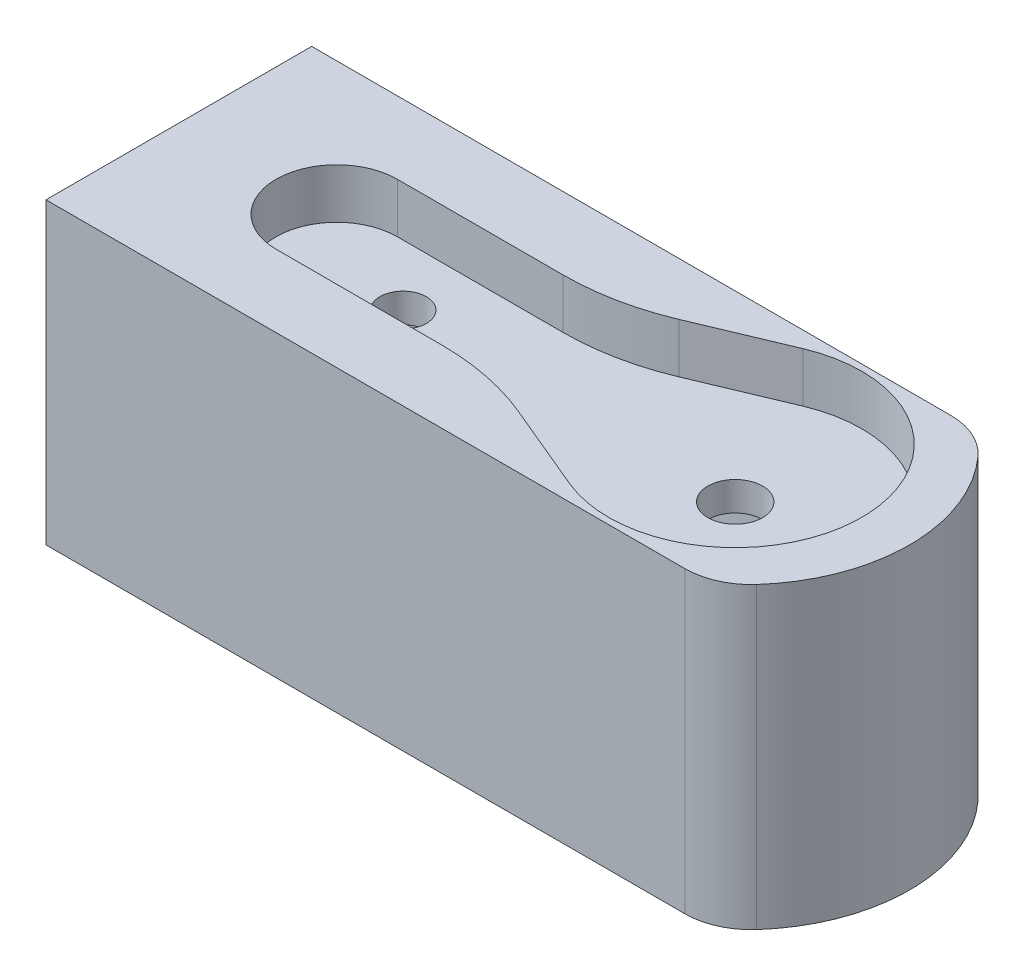
ISO-10303-21;
HEADER;
FILE_DESCRIPTION(('STEP AP214'),'2;1');
FILE_NAME('part.step','',(''),(''),'','','');
FILE_SCHEMA(('AUTOMOTIVE_DESIGN { 1 0 10303 214 1 1 1 1 }'));
ENDSEC;
DATA;
#1=APPLICATION_CONTEXT('core data for automotive mechanical design processes');
#2=APPLICATION_PROTOCOL_DEFINITION('international standard','automotive_design',2000,#1);
#3=PRODUCT_CONTEXT('',#1,'mechanical');
#4=PRODUCT('Part','Part','',(#3));
#5=PRODUCT_RELATED_PRODUCT_CATEGORY('part','',(#4));
#6=PRODUCT_DEFINITION_FORMATION('','',#4);
#7=PRODUCT_DEFINITION_CONTEXT('part definition',#1,'design');
#8=PRODUCT_DEFINITION('design','',#6,#7);
#9=PRODUCT_DEFINITION_SHAPE('','',#8);
#10=(LENGTH_UNIT() NAMED_UNIT(*) SI_UNIT(.MILLI.,.METRE.));
#11=(NAMED_UNIT(*) PLANE_ANGLE_UNIT() SI_UNIT($,.RADIAN.));
#12=(NAMED_UNIT(*) SI_UNIT($,.STERADIAN.) SOLID_ANGLE_UNIT());
#13=UNCERTAINTY_MEASURE_WITH_UNIT(LENGTH_MEASURE(1.E-05),#10,'distance_accuracy_value','');
#14=(GEOMETRIC_REPRESENTATION_CONTEXT(3) GLOBAL_UNCERTAINTY_ASSIGNED_CONTEXT((#13)) GLOBAL_UNIT_ASSIGNED_CONTEXT((#10,
#11,#12)) REPRESENTATION_CONTEXT('',''));
#15=CARTESIAN_POINT('',(0.,0.,0.));
#16=DIRECTION('',(0.,0.,1.));
#17=DIRECTION('',(1.,0.,0.));
#18=AXIS2_PLACEMENT_3D('',#15,#16,#17);
#19=CARTESIAN_POINT('',(0.,-2.,0.));
#20=DIRECTION('',(0.,0.,1.));
#21=DIRECTION('',(1.,0.,0.));
#22=AXIS2_PLACEMENT_3D('',#19,#20,#21);
#23=PLANE('',#22);
#24=DIRECTION('',(0.,1.,0.));
#25=VECTOR('',#24,1.);
#26=CARTESIAN_POINT('',(23.4772847206615,-2.,0.));
#27=LINE('',#26,#25);
#28=CARTESIAN_POINT('',(23.4772847206614,-2.,0.));
#29=VERTEX_POINT('',#28);
#30=CARTESIAN_POINT('',(23.4772847206614,16.,0.));
#31=VERTEX_POINT('',#30);
#32=EDGE_CURVE('E317',#29,#31,#27,.T.);
#33=ORIENTED_EDGE('',*,*,#32,.T.);
#34=DIRECTION('',(-1.,0.,0.));
#35=VECTOR('',#34,1.);
#36=CARTESIAN_POINT('',(0.,16.,0.));
#37=LINE('',#36,#35);
#38=CARTESIAN_POINT('',(-15.,16.,0.));
#39=VERTEX_POINT('',#38);
#40=EDGE_CURVE('E235',#31,#39,#37,.T.);
#41=ORIENTED_EDGE('',*,*,#40,.T.);
#42=DIRECTION('',(0.,1.,0.));
#43=VECTOR('',#42,1.);
#44=CARTESIAN_POINT('',(-15.,-2.,0.));
#45=LINE('',#44,#43);
#46=CARTESIAN_POINT('',(-15.,-2.,0.));
#47=VERTEX_POINT('',#46);
#48=EDGE_CURVE('E303',#47,#39,#45,.T.);
#49=ORIENTED_EDGE('',*,*,#48,.F.);
#50=DIRECTION('',(1.,0.,0.));
#51=VECTOR('',#50,1.);
#52=CARTESIAN_POINT('',(0.,-2.,0.));
#53=LINE('',#52,#51);
#54=EDGE_CURVE('E309',#47,#29,#53,.T.);
#55=ORIENTED_EDGE('',*,*,#54,.T.);
#56=EDGE_LOOP('',(#33,#41,#49,#55));
#57=FACE_BOUND('',#56,.T.);
#58=ADVANCED_FACE('F38',(#57),#23,.T.);
#59=CARTESIAN_POINT('',(0.,-2.,-16.));
#60=DIRECTION('',(0.,0.,-1.));
#61=DIRECTION('',(-1.,0.,0.));
#62=AXIS2_PLACEMENT_3D('',#59,#60,#61);
#63=PLANE('',#62);
#64=DIRECTION('',(0.,-1.,0.));
#65=VECTOR('',#64,1.);
#66=CARTESIAN_POINT('',(-15.,-2.,-16.));
#67=LINE('',#66,#65);
#68=CARTESIAN_POINT('',(-15.,16.,-16.));
#69=VERTEX_POINT('',#68);
#70=CARTESIAN_POINT('',(-15.,-2.,-16.));
#71=VERTEX_POINT('',#70);
#72=EDGE_CURVE('E298',#69,#71,#67,.T.);
#73=ORIENTED_EDGE('',*,*,#72,.F.);
#74=DIRECTION('',(1.,0.,0.));
#75=VECTOR('',#74,1.);
#76=CARTESIAN_POINT('',(0.,16.,-16.));
#77=LINE('',#76,#75);
#78=CARTESIAN_POINT('',(23.4772847206614,16.,-16.));
#79=VERTEX_POINT('',#78);
#80=EDGE_CURVE('E55',#69,#79,#77,.T.);
#81=ORIENTED_EDGE('',*,*,#80,.T.);
#82=DIRECTION('',(0.,1.,0.));
#83=VECTOR('',#82,1.);
#84=CARTESIAN_POINT('',(23.4772847206614,-2.,-16.));
#85=LINE('',#84,#83);
#86=CARTESIAN_POINT('',(23.4772847206614,-2.,-16.));
#87=VERTEX_POINT('',#86);
#88=EDGE_CURVE('E11',#79,#87,#85,.F.);
#89=ORIENTED_EDGE('',*,*,#88,.T.);
#90=DIRECTION('',(-1.,0.,0.));
#91=VECTOR('',#90,1.);
#92=CARTESIAN_POINT('',(0.,-2.,-16.));
#93=LINE('',#92,#91);
#94=EDGE_CURVE('E315',#87,#71,#93,.T.);
#95=ORIENTED_EDGE('',*,*,#94,.T.);
#96=EDGE_LOOP('',(#73,#81,#89,#95));
#97=FACE_BOUND('',#96,.T.);
#98=ADVANCED_FACE('F346',(#97),#63,.T.);
#99=CARTESIAN_POINT('',(19.0051487656619,-2.,-8.));
#100=DIRECTION('',(0.,1.,0.));
#101=DIRECTION('',(0.,0.,1.));
#102=AXIS2_PLACEMENT_3D('',#99,#100,#101);
#103=CYLINDRICAL_SURFACE('',#102,10.);
#104=DIRECTION('',(0.,1.,0.));
#105=VECTOR('',#104,1.);
#106=CARTESIAN_POINT('',(26.4587086906612,-2.,-14.6666666666667));
#107=LINE('',#106,#105);
#108=CARTESIAN_POINT('',(26.4587086906612,-2.,-14.6666666666667));
#109=VERTEX_POINT('',#108);
#110=CARTESIAN_POINT('',(26.4587086906612,16.,-14.6666666666667));
#111=VERTEX_POINT('',#110);
#112=EDGE_CURVE('E320',#109,#111,#107,.T.);
#113=ORIENTED_EDGE('',*,*,#112,.T.);
#114=CARTESIAN_POINT('',(19.0051487656619,16.,-8.));
#115=DIRECTION('',(0.,1.,0.));
#116=DIRECTION('',(0.,0.,1.));
#117=AXIS2_PLACEMENT_3D('',#114,#115,#116);
#118=CIRCLE('',#117,10.);
#119=CARTESIAN_POINT('',(26.4587086906612,16.,-1.33333333333334));
#120=VERTEX_POINT('',#119);
#121=EDGE_CURVE('E243',#111,#120,#118,.F.);
#122=ORIENTED_EDGE('',*,*,#121,.T.);
#123=DIRECTION('',(0.,1.,0.));
#124=VECTOR('',#123,1.);
#125=CARTESIAN_POINT('',(26.4587086906612,-2.,-1.33333333333334));
#126=LINE('',#125,#124);
#127=CARTESIAN_POINT('',(26.4587086906612,-2.,-1.33333333333334));
#128=VERTEX_POINT('',#127);
#129=EDGE_CURVE('E323',#120,#128,#126,.F.);
#130=ORIENTED_EDGE('',*,*,#129,.T.);
#131=CARTESIAN_POINT('',(19.0051487656619,-2.,-8.));
#132=DIRECTION('',(0.,1.,0.));
#133=DIRECTION('',(0.,0.,1.));
#134=AXIS2_PLACEMENT_3D('',#131,#132,#133);
#135=CIRCLE('',#134,10.);
#136=EDGE_CURVE('E312',#128,#109,#135,.T.);
#137=ORIENTED_EDGE('',*,*,#136,.T.);
#138=EDGE_LOOP('',(#113,#122,#130,#137));
#139=FACE_BOUND('',#138,.T.);
#140=ADVANCED_FACE('F352',(#139),#103,.T.);
#141=CARTESIAN_POINT('',(23.4772847206615,-2.,-4.));
#142=DIRECTION('',(0.,1.,0.));
#143=DIRECTION('',(0.,0.,1.));
#144=AXIS2_PLACEMENT_3D('',#141,#142,#143);
#145=CYLINDRICAL_SURFACE('',#144,4.);
#146=ORIENTED_EDGE('',*,*,#129,.F.);
#147=CARTESIAN_POINT('',(23.4772847206615,16.,-4.));
#148=DIRECTION('',(0.,1.,0.));
#149=DIRECTION('',(0.,0.,1.));
#150=AXIS2_PLACEMENT_3D('',#147,#148,#149);
#151=CIRCLE('',#150,4.);
#152=EDGE_CURVE('E240',#120,#31,#151,.F.);
#153=ORIENTED_EDGE('',*,*,#152,.T.);
#154=ORIENTED_EDGE('',*,*,#32,.F.);
#155=CARTESIAN_POINT('',(23.4772847206615,-2.,-4.));
#156=DIRECTION('',(0.,1.,0.));
#157=DIRECTION('',(0.,0.,1.));
#158=AXIS2_PLACEMENT_3D('',#155,#156,#157);
#159=CIRCLE('',#158,4.);
#160=EDGE_CURVE('E47',#128,#29,#159,.F.);
#161=ORIENTED_EDGE('',*,*,#160,.F.);
#162=EDGE_LOOP('',(#146,#153,#154,#161));
#163=FACE_BOUND('',#162,.T.);
#164=ADVANCED_FACE('F355',(#163),#145,.T.);
#165=CARTESIAN_POINT('',(23.4772847206614,-2.,-12.));
#166=DIRECTION('',(0.,1.,0.));
#167=DIRECTION('',(0.,0.,1.));
#168=AXIS2_PLACEMENT_3D('',#165,#166,#167);
#169=CYLINDRICAL_SURFACE('',#168,4.);
#170=ORIENTED_EDGE('',*,*,#88,.F.);
#171=CARTESIAN_POINT('',(23.4772847206614,16.,-12.));
#172=DIRECTION('',(0.,1.,0.));
#173=DIRECTION('',(0.,0.,1.));
#174=AXIS2_PLACEMENT_3D('',#171,#172,#173);
#175=CIRCLE('',#174,4.);
#176=EDGE_CURVE('E237',#79,#111,#175,.F.);
#177=ORIENTED_EDGE('',*,*,#176,.T.);
#178=ORIENTED_EDGE('',*,*,#112,.F.);
#179=CARTESIAN_POINT('',(23.4772847206614,-2.,-12.));
#180=DIRECTION('',(0.,1.,0.));
#181=DIRECTION('',(0.,0.,1.));
#182=AXIS2_PLACEMENT_3D('',#179,#180,#181);
#183=CIRCLE('',#182,4.);
#184=EDGE_CURVE('E325',#87,#109,#183,.F.);
#185=ORIENTED_EDGE('',*,*,#184,.F.);
#186=EDGE_LOOP('',(#170,#177,#178,#185));
#187=FACE_BOUND('',#186,.T.);
#188=ADVANCED_FACE('F40',(#187),#169,.T.);
#189=CARTESIAN_POINT('',(-15.,0.,0.));
#190=DIRECTION('',(1.,0.,0.));
#191=DIRECTION('',(0.,0.,-1.));
#192=AXIS2_PLACEMENT_3D('',#189,#190,#191);
#193=PLANE('',#192);
#194=DIRECTION('',(0.,1.,0.));
#195=VECTOR('',#194,1.);
#196=CARTESIAN_POINT('',(-15.,13.25,-2.75));
#197=LINE('',#196,#195);
#198=CARTESIAN_POINT('',(-15.,0.749999999999997,-2.75));
#199=VERTEX_POINT('',#198);
#200=CARTESIAN_POINT('',(-15.,11.25,-2.75));
#201=VERTEX_POINT('',#200);
#202=EDGE_CURVE('E294',#199,#201,#197,.T.);
#203=ORIENTED_EDGE('',*,*,#202,.F.);
#204=DIRECTION('',(0.,0.,1.));
#205=VECTOR('',#204,1.);
#206=CARTESIAN_POINT('',(-15.,0.749999999999997,-2.75));
#207=LINE('',#206,#205);
#208=CARTESIAN_POINT('',(-15.,0.749999999999997,-13.25));
#209=VERTEX_POINT('',#208);
#210=EDGE_CURVE('E187',#209,#199,#207,.T.);
#211=ORIENTED_EDGE('',*,*,#210,.F.);
#212=DIRECTION('',(0.,-1.,0.));
#213=VECTOR('',#212,1.);
#214=CARTESIAN_POINT('',(-15.,2.75,-13.25));
#215=LINE('',#214,#213);
#216=CARTESIAN_POINT('',(-15.,11.25,-13.25));
#217=VERTEX_POINT('',#216);
#218=EDGE_CURVE('E296',#217,#209,#215,.T.);
#219=ORIENTED_EDGE('',*,*,#218,.F.);
#220=DIRECTION('',(0.,0.,-1.));
#221=VECTOR('',#220,1.);
#222=CARTESIAN_POINT('',(-15.,11.25,-13.25));
#223=LINE('',#222,#221);
#224=EDGE_CURVE('E190',#201,#217,#223,.T.);
#225=ORIENTED_EDGE('',*,*,#224,.F.);
#226=EDGE_LOOP('',(#203,#211,#219,#225));
#227=FACE_BOUND('',#226,.T.);
#228=DIRECTION('',(0.,0.,1.));
#229=VECTOR('',#228,1.);
#230=CARTESIAN_POINT('',(-15.,16.,0.));
#231=LINE('',#230,#229);
#232=EDGE_CURVE('E232',#69,#39,#231,.T.);
#233=ORIENTED_EDGE('',*,*,#232,.F.);
#234=ORIENTED_EDGE('',*,*,#72,.T.);
#235=DIRECTION('',(0.,0.,1.));
#236=VECTOR('',#235,1.);
#237=CARTESIAN_POINT('',(-15.,-2.,0.));
#238=LINE('',#237,#236);
#239=EDGE_CURVE('E300',#71,#47,#238,.T.);
#240=ORIENTED_EDGE('',*,*,#239,.T.);
#241=ORIENTED_EDGE('',*,*,#48,.T.);
#242=EDGE_LOOP('',(#233,#234,#240,#241));
#243=FACE_BOUND('',#242,.T.);
#244=ADVANCED_FACE('F362',(#227,#243),#193,.F.);
#245=CARTESIAN_POINT('',(-3.03344012728045,13.,-7.22587350151138));
#246=DIRECTION('',(0.387077720728365,0.,0.922047091051067));
#247=DIRECTION('',(0.922047091051067,0.,-0.387077720728365));
#248=AXIS2_PLACEMENT_3D('',#245,#246,#247);
#249=PLANE('',#248);
#250=DIRECTION('',(0.,1.,0.));
#251=VECTOR('',#250,1.);
#252=CARTESIAN_POINT('',(15.5543287995448,13.,-15.0290663096134));
#253=LINE('',#252,#251);
#254=CARTESIAN_POINT('',(15.5543287995448,13.,-15.0290663096134));
#255=VERTEX_POINT('',#254);
#256=CARTESIAN_POINT('',(15.5543287995448,16.,-15.0290663096134));
#257=VERTEX_POINT('',#256);
#258=EDGE_CURVE('E268',#255,#257,#253,.T.);
#259=ORIENTED_EDGE('',*,*,#258,.T.);
#260=DIRECTION('',(-0.922047091051067,0.,0.387077720728365));
#261=VECTOR('',#260,1.);
#262=CARTESIAN_POINT('',(-3.03344012728045,16.,-7.22587350151138));
#263=LINE('',#262,#261);
#264=CARTESIAN_POINT('',(10.2904906654779,16.,-12.819293634234));
#265=VERTEX_POINT('',#264);
#266=EDGE_CURVE('E227',#257,#265,#263,.T.);
#267=ORIENTED_EDGE('',*,*,#266,.T.);
#268=DIRECTION('',(0.,1.,0.));
#269=VECTOR('',#268,1.);
#270=CARTESIAN_POINT('',(10.2904906654779,13.,-12.819293634234));
#271=LINE('',#270,#269);
#272=CARTESIAN_POINT('',(10.2904906654779,13.,-12.819293634234));
#273=VERTEX_POINT('',#272);
#274=EDGE_CURVE('E267',#273,#265,#271,.T.);
#275=ORIENTED_EDGE('',*,*,#274,.F.);
#276=DIRECTION('',(0.922047091051067,0.,-0.387077720728365));
#277=VECTOR('',#276,1.);
#278=CARTESIAN_POINT('',(-3.03344012728045,13.,-7.22587350151138));
#279=LINE('',#278,#277);
#280=EDGE_CURVE('E246',#273,#255,#279,.T.);
#281=ORIENTED_EDGE('',*,*,#280,.T.);
#282=EDGE_LOOP('',(#259,#267,#275,#281));
#283=FACE_BOUND('',#282,.T.);
#284=ADVANCED_FACE('F379',(#283),#249,.T.);
#285=CARTESIAN_POINT('',(18.5051487656619,13.,-8.));
#286=DIRECTION('',(0.,1.,0.));
#287=DIRECTION('',(0.,0.,1.));
#288=AXIS2_PLACEMENT_3D('',#285,#286,#287);
#289=CYLINDRICAL_SURFACE('',#288,7.62332681034841);
#290=CARTESIAN_POINT('',(18.5051487656619,16.,-8.));
#291=DIRECTION('',(0.,1.,0.));
#292=DIRECTION('',(0.,0.,1.));
#293=AXIS2_PLACEMENT_3D('',#290,#291,#292);
#294=CIRCLE('',#293,7.62332681034841);
#295=CARTESIAN_POINT('',(15.5616217683061,16.,-0.96787653171429));
#296=VERTEX_POINT('',#295);
#297=EDGE_CURVE('E225',#257,#296,#294,.F.);
#298=ORIENTED_EDGE('',*,*,#297,.F.);
#299=ORIENTED_EDGE('',*,*,#258,.F.);
#300=CARTESIAN_POINT('',(18.5051487656619,13.,-8.));
#301=DIRECTION('',(0.,1.,0.));
#302=DIRECTION('',(0.,0.,1.));
#303=AXIS2_PLACEMENT_3D('',#300,#301,#302);
#304=CIRCLE('',#303,7.62332681034841);
#305=CARTESIAN_POINT('',(15.5616217683061,13.,-0.96787653171429));
#306=VERTEX_POINT('',#305);
#307=EDGE_CURVE('E264',#306,#255,#304,.T.);
#308=ORIENTED_EDGE('',*,*,#307,.F.);
#309=DIRECTION('',(0.,1.,0.));
#310=VECTOR('',#309,1.);
#311=CARTESIAN_POINT('',(15.5616217683061,13.,-0.96787653171429));
#312=LINE('',#311,#310);
#313=EDGE_CURVE('E272',#306,#296,#312,.T.);
#314=ORIENTED_EDGE('',*,*,#313,.T.);
#315=EDGE_LOOP('',(#298,#299,#308,#314));
#316=FACE_BOUND('',#315,.T.);
#317=ADVANCED_FACE('F385',(#316),#289,.F.);
#318=CARTESIAN_POINT('',(2.66480895084838,13.,-6.36626250705112));
#319=DIRECTION('',(-0.386121055883373,0.,0.922448117892551));
#320=DIRECTION('',(0.922448117892551,0.,0.386121055883373));
#321=AXIS2_PLACEMENT_3D('',#318,#319,#320);
#322=PLANE('',#321);
#323=DIRECTION('',(-0.922448117892551,0.,-0.386121055883373));
#324=VECTOR('',#323,1.);
#325=CARTESIAN_POINT('',(2.66480895084838,16.,-6.36626250705112));
#326=LINE('',#325,#324);
#327=CARTESIAN_POINT('',(10.27610939416,16.,-3.18030190199151));
#328=VERTEX_POINT('',#327);
#329=EDGE_CURVE('E223',#296,#328,#326,.T.);
#330=ORIENTED_EDGE('',*,*,#329,.F.);
#331=ORIENTED_EDGE('',*,*,#313,.F.);
#332=DIRECTION('',(0.922448117892551,0.,0.386121055883373));
#333=VECTOR('',#332,1.);
#334=CARTESIAN_POINT('',(2.66480895084838,13.,-6.36626250705112));
#335=LINE('',#334,#333);
#336=CARTESIAN_POINT('',(10.27610939416,13.,-3.18030190199151));
#337=VERTEX_POINT('',#336);
#338=EDGE_CURVE('E261',#337,#306,#335,.T.);
#339=ORIENTED_EDGE('',*,*,#338,.F.);
#340=DIRECTION('',(0.,1.,0.));
#341=VECTOR('',#340,1.);
#342=CARTESIAN_POINT('',(10.27610939416,13.,-3.18030190199151));
#343=LINE('',#342,#341);
#344=EDGE_CURVE('E275',#337,#328,#343,.T.);
#345=ORIENTED_EDGE('',*,*,#344,.T.);
#346=EDGE_LOOP('',(#330,#331,#339,#345));
#347=FACE_BOUND('',#346,.T.);
#348=ADVANCED_FACE('F433',(#347),#322,.F.);
#349=CARTESIAN_POINT('',(4.48429355590932,13.,10.6564198663967));
#350=DIRECTION('',(0.,1.,0.));
#351=DIRECTION('',(0.,0.,1.));
#352=AXIS2_PLACEMENT_3D('',#349,#350,#351);
#353=CYLINDRICAL_SURFACE('',#352,15.);
#354=DIRECTION('',(0.,1.,0.));
#355=VECTOR('',#354,1.);
#356=CARTESIAN_POINT('',(4.4939388173547,13.,-4.34357703256733));
#357=LINE('',#356,#355);
#358=CARTESIAN_POINT('',(4.4939388173547,13.,-4.34357703256733));
#359=VERTEX_POINT('',#358);
#360=CARTESIAN_POINT('',(4.49393881735469,16.,-4.34357703256733));
#361=VERTEX_POINT('',#360);
#362=EDGE_CURVE('E278',#359,#361,#357,.T.);
#363=ORIENTED_EDGE('',*,*,#362,.T.);
#364=CARTESIAN_POINT('',(4.48429355590932,16.,10.6564198663967));
#365=DIRECTION('',(0.,1.,0.));
#366=DIRECTION('',(0.,0.,1.));
#367=AXIS2_PLACEMENT_3D('',#364,#365,#366);
#368=CIRCLE('',#367,15.);
#369=EDGE_CURVE('E220',#361,#328,#368,.F.);
#370=ORIENTED_EDGE('',*,*,#369,.T.);
#371=ORIENTED_EDGE('',*,*,#344,.F.);
#372=CARTESIAN_POINT('',(4.48429355590932,13.,10.6564198663967));
#373=DIRECTION('',(0.,1.,0.));
#374=DIRECTION('',(0.,0.,1.));
#375=AXIS2_PLACEMENT_3D('',#372,#373,#374);
#376=CIRCLE('',#375,15.);
#377=EDGE_CURVE('E259',#337,#359,#376,.T.);
#378=ORIENTED_EDGE('',*,*,#377,.T.);
#379=EDGE_LOOP('',(#363,#370,#371,#378));
#380=FACE_BOUND('',#379,.T.);
#381=ADVANCED_FACE('F437',(#380),#353,.T.);
#382=CARTESIAN_POINT('',(4.48432485455238,13.,-26.65));
#383=DIRECTION('',(0.,1.,0.));
#384=DIRECTION('',(0.,0.,1.));
#385=AXIS2_PLACEMENT_3D('',#382,#383,#384);
#386=CYLINDRICAL_SURFACE('',#385,15.);
#387=CARTESIAN_POINT('',(4.48432485455238,16.,-26.65));
#388=DIRECTION('',(0.,1.,0.));
#389=DIRECTION('',(0.,0.,1.));
#390=AXIS2_PLACEMENT_3D('',#387,#388,#389);
#391=CIRCLE('',#390,15.);
#392=CARTESIAN_POINT('',(4.48432485455233,16.,-11.65));
#393=VERTEX_POINT('',#392);
#394=EDGE_CURVE('E230',#393,#265,#391,.T.);
#395=ORIENTED_EDGE('',*,*,#394,.F.);
#396=DIRECTION('',(0.,1.,0.));
#397=VECTOR('',#396,1.);
#398=CARTESIAN_POINT('',(4.48432485455233,13.,-11.65));
#399=LINE('',#398,#397);
#400=CARTESIAN_POINT('',(4.48432485455233,13.,-11.65));
#401=VERTEX_POINT('',#400);
#402=EDGE_CURVE('E284',#401,#393,#399,.T.);
#403=ORIENTED_EDGE('',*,*,#402,.F.);
#404=CARTESIAN_POINT('',(4.48432485455238,13.,-26.65));
#405=DIRECTION('',(0.,1.,0.));
#406=DIRECTION('',(0.,0.,1.));
#407=AXIS2_PLACEMENT_3D('',#404,#405,#406);
#408=CIRCLE('',#407,15.);
#409=EDGE_CURVE('E248',#273,#401,#408,.F.);
#410=ORIENTED_EDGE('',*,*,#409,.F.);
#411=ORIENTED_EDGE('',*,*,#274,.T.);
#412=EDGE_LOOP('',(#395,#403,#410,#411));
#413=FACE_BOUND('',#412,.T.);
#414=ADVANCED_FACE('F441',(#413),#386,.T.);
#415=CARTESIAN_POINT('',(18.5051487656619,-6.,-8.));
#416=DIRECTION('',(0.,1.,0.));
#417=DIRECTION('',(0.,0.,1.));
#418=AXIS2_PLACEMENT_3D('',#415,#416,#417);
#419=CYLINDRICAL_SURFACE('',#418,1.65);
#420=CARTESIAN_POINT('',(18.5051487656619,11.25,-8.));
#421=DIRECTION('',(0.,1.,0.));
#422=DIRECTION('',(0.,0.,1.));
#423=AXIS2_PLACEMENT_3D('',#420,#421,#422);
#424=CIRCLE('',#423,1.65);
#425=CARTESIAN_POINT('',(18.5051487656619,11.25,-6.35));
#426=VERTEX_POINT('',#425);
#427=EDGE_CURVE('E208',#426,#426,#424,.F.);
#428=ORIENTED_EDGE('',*,*,#427,.T.);
#429=EDGE_LOOP('',(#428));
#430=FACE_BOUND('',#429,.T.);
#431=CARTESIAN_POINT('',(18.5051487656619,13.,-8.));
#432=DIRECTION('',(0.,1.,0.));
#433=DIRECTION('',(0.,0.,1.));
#434=AXIS2_PLACEMENT_3D('',#431,#432,#433);
#435=CIRCLE('',#434,1.65);
#436=CARTESIAN_POINT('',(18.5051487656619,13.,-6.35));
#437=VERTEX_POINT('',#436);
#438=EDGE_CURVE('E288',#437,#437,#435,.F.);
#439=ORIENTED_EDGE('',*,*,#438,.F.);
#440=EDGE_LOOP('',(#439));
#441=FACE_BOUND('',#440,.T.);
#442=ADVANCED_FACE('F402',(#430,#441),#419,.F.);
#443=CARTESIAN_POINT('',(-1.49485123433813,-7.00000000000001,-8.));
#444=DIRECTION('',(0.,1.,0.));
#445=DIRECTION('',(0.,0.,1.));
#446=AXIS2_PLACEMENT_3D('',#443,#444,#445);
#447=CYLINDRICAL_SURFACE('',#446,1.4);
#448=CARTESIAN_POINT('',(-1.49485123433813,11.25,-8.));
#449=DIRECTION('',(0.,1.,0.));
#450=DIRECTION('',(0.,0.,1.));
#451=AXIS2_PLACEMENT_3D('',#448,#449,#450);
#452=CIRCLE('',#451,1.4);
#453=CARTESIAN_POINT('',(-1.49485123433813,11.25,-6.6));
#454=VERTEX_POINT('',#453);
#455=EDGE_CURVE('E42',#454,#454,#452,.F.);
#456=ORIENTED_EDGE('',*,*,#455,.T.);
#457=EDGE_LOOP('',(#456));
#458=FACE_BOUND('',#457,.T.);
#459=CARTESIAN_POINT('',(-1.49485123433813,13.,-8.));
#460=DIRECTION('',(0.,1.,0.));
#461=DIRECTION('',(0.,0.,1.));
#462=AXIS2_PLACEMENT_3D('',#459,#460,#461);
#463=CIRCLE('',#462,1.4);
#464=CARTESIAN_POINT('',(-1.49485123433813,13.,-6.6));
#465=VERTEX_POINT('',#464);
#466=EDGE_CURVE('E271',#465,#465,#463,.F.);
#467=ORIENTED_EDGE('',*,*,#466,.F.);
#468=EDGE_LOOP('',(#467));
#469=FACE_BOUND('',#468,.T.);
#470=ADVANCED_FACE('F404',(#458,#469),#447,.F.);
#471=CARTESIAN_POINT('',(19.0051487656619,-2.,-8.));
#472=DIRECTION('',(0.,1.,0.));
#473=DIRECTION('',(0.,0.,1.));
#474=AXIS2_PLACEMENT_3D('',#471,#472,#473);
#475=PLANE('',#474);
#476=CARTESIAN_POINT('',(-1.49485123433813,-2.,-8.));
#477=DIRECTION('',(0.,1.,0.));
#478=DIRECTION('',(0.,0.,1.));
#479=AXIS2_PLACEMENT_3D('',#476,#477,#478);
#480=CIRCLE('',#479,1.4);
#481=CARTESIAN_POINT('',(-1.49485123433813,-2.,-6.6));
#482=VERTEX_POINT('',#481);
#483=EDGE_CURVE('E291',#482,#482,#480,.T.);
#484=ORIENTED_EDGE('',*,*,#483,.T.);
#485=EDGE_LOOP('',(#484));
#486=FACE_BOUND('',#485,.T.);
#487=CARTESIAN_POINT('',(18.5051487656619,-2.,-8.));
#488=DIRECTION('',(0.,1.,0.));
#489=DIRECTION('',(0.,0.,1.));
#490=AXIS2_PLACEMENT_3D('',#487,#488,#489);
#491=CIRCLE('',#490,1.65);
#492=CARTESIAN_POINT('',(18.5051487656619,-2.,-6.35));
#493=VERTEX_POINT('',#492);
#494=EDGE_CURVE('E176',#493,#493,#491,.T.);
#495=ORIENTED_EDGE('',*,*,#494,.T.);
#496=EDGE_LOOP('',(#495));
#497=FACE_BOUND('',#496,.T.);
#498=ORIENTED_EDGE('',*,*,#136,.F.);
#499=ORIENTED_EDGE('',*,*,#160,.T.);
#500=ORIENTED_EDGE('',*,*,#54,.F.);
#501=ORIENTED_EDGE('',*,*,#239,.F.);
#502=ORIENTED_EDGE('',*,*,#94,.F.);
#503=ORIENTED_EDGE('',*,*,#184,.T.);
#504=EDGE_LOOP('',(#498,#499,#500,#501,#502,#503));
#505=FACE_BOUND('',#504,.T.);
#506=ADVANCED_FACE('F371',(#486,#497,#505),#475,.F.);
#507=CARTESIAN_POINT('',(18.5051487656619,0.749999999999997,-8.));
#508=DIRECTION('',(0.,-1.,0.));
#509=DIRECTION('',(0.,0.,-1.));
#510=AXIS2_PLACEMENT_3D('',#507,#508,#509);
#511=CIRCLE('',#510,1.65);
#512=CARTESIAN_POINT('',(18.5051487656619,0.749999999999997,-9.65));
#513=VERTEX_POINT('',#512);
#514=EDGE_CURVE('E205',#513,#513,#511,.F.);
#515=ORIENTED_EDGE('',*,*,#514,.T.);
#516=EDGE_LOOP('',(#515));
#517=FACE_BOUND('',#516,.T.);
#518=ORIENTED_EDGE('',*,*,#494,.F.);
#519=EDGE_LOOP('',(#518));
#520=FACE_BOUND('',#519,.T.);
#521=ADVANCED_FACE('F397',(#517,#520),#419,.F.);
#522=CARTESIAN_POINT('',(24.,2.75,-13.25));
#523=DIRECTION('',(0.,0.,-1.));
#524=DIRECTION('',(-1.,0.,0.));
#525=AXIS2_PLACEMENT_3D('',#522,#523,#524);
#526=PLANE('',#525);
#527=DIRECTION('',(0.,-1.,0.));
#528=VECTOR('',#527,1.);
#529=CARTESIAN_POINT('',(24.,2.75,-13.25));
#530=LINE('',#529,#528);
#531=CARTESIAN_POINT('',(24.,11.25,-13.25));
#532=VERTEX_POINT('',#531);
#533=CARTESIAN_POINT('',(24.,0.749999999999997,-13.25));
#534=VERTEX_POINT('',#533);
#535=EDGE_CURVE('E177',#532,#534,#530,.T.);
#536=ORIENTED_EDGE('',*,*,#535,.F.);
#537=DIRECTION('',(-1.,0.,0.));
#538=VECTOR('',#537,1.);
#539=CARTESIAN_POINT('',(38.8492424049175,11.25,-13.25));
#540=LINE('',#539,#538);
#541=EDGE_CURVE('E198',#532,#217,#540,.T.);
#542=ORIENTED_EDGE('',*,*,#541,.T.);
#543=ORIENTED_EDGE('',*,*,#218,.T.);
#544=DIRECTION('',(-1.,0.,0.));
#545=VECTOR('',#544,1.);
#546=CARTESIAN_POINT('',(38.8492424049175,0.749999999999997,-13.25));
#547=LINE('',#546,#545);
#548=EDGE_CURVE('E201',#534,#209,#547,.T.);
#549=ORIENTED_EDGE('',*,*,#548,.F.);
#550=EDGE_LOOP('',(#536,#542,#543,#549));
#551=FACE_BOUND('',#550,.T.);
#552=ADVANCED_FACE('F394',(#551),#526,.F.);
#553=CARTESIAN_POINT('',(24.,13.25,-2.75));
#554=DIRECTION('',(0.,0.,1.));
#555=DIRECTION('',(1.,0.,0.));
#556=AXIS2_PLACEMENT_3D('',#553,#554,#555);
#557=PLANE('',#556);
#558=ORIENTED_EDGE('',*,*,#202,.T.);
#559=DIRECTION('',(-1.,0.,0.));
#560=VECTOR('',#559,1.);
#561=CARTESIAN_POINT('',(38.8492424049175,11.25,-2.75));
#562=LINE('',#561,#560);
#563=CARTESIAN_POINT('',(24.,11.25,-2.75));
#564=VERTEX_POINT('',#563);
#565=EDGE_CURVE('E171',#564,#201,#562,.T.);
#566=ORIENTED_EDGE('',*,*,#565,.F.);
#567=DIRECTION('',(0.,1.,0.));
#568=VECTOR('',#567,1.);
#569=CARTESIAN_POINT('',(24.,13.25,-2.75));
#570=LINE('',#569,#568);
#571=CARTESIAN_POINT('',(24.,0.749999999999997,-2.75));
#572=VERTEX_POINT('',#571);
#573=EDGE_CURVE('E165',#572,#564,#570,.T.);
#574=ORIENTED_EDGE('',*,*,#573,.F.);
#575=DIRECTION('',(-1.,0.,0.));
#576=VECTOR('',#575,1.);
#577=CARTESIAN_POINT('',(38.8492424049175,0.749999999999997,-2.75));
#578=LINE('',#577,#576);
#579=EDGE_CURVE('E168',#572,#199,#578,.T.);
#580=ORIENTED_EDGE('',*,*,#579,.T.);
#581=EDGE_LOOP('',(#558,#566,#574,#580));
#582=FACE_BOUND('',#581,.T.);
#583=ADVANCED_FACE('F167',(#582),#557,.F.);
#584=CARTESIAN_POINT('',(24.,0.,0.));
#585=DIRECTION('',(1.,0.,0.));
#586=DIRECTION('',(0.,0.,-1.));
#587=AXIS2_PLACEMENT_3D('',#584,#585,#586);
#588=PLANE('',#587);
#589=ORIENTED_EDGE('',*,*,#573,.T.);
#590=DIRECTION('',(0.,0.,-1.));
#591=VECTOR('',#590,1.);
#592=CARTESIAN_POINT('',(24.,11.25,-13.25));
#593=LINE('',#592,#591);
#594=EDGE_CURVE('E196',#564,#532,#593,.T.);
#595=ORIENTED_EDGE('',*,*,#594,.T.);
#596=ORIENTED_EDGE('',*,*,#535,.T.);
#597=DIRECTION('',(0.,0.,1.));
#598=VECTOR('',#597,1.);
#599=CARTESIAN_POINT('',(24.,0.749999999999997,-2.75));
#600=LINE('',#599,#598);
#601=EDGE_CURVE('E184',#534,#572,#600,.T.);
#602=ORIENTED_EDGE('',*,*,#601,.T.);
#603=EDGE_LOOP('',(#589,#595,#596,#602));
#604=FACE_BOUND('',#603,.T.);
#605=ADVANCED_FACE('F189',(#604),#588,.F.);
#606=CARTESIAN_POINT('',(-1.49485123433813,0.749999999999997,-8.));
#607=DIRECTION('',(0.,-1.,0.));
#608=DIRECTION('',(0.,0.,-1.));
#609=AXIS2_PLACEMENT_3D('',#606,#607,#608);
#610=CIRCLE('',#609,1.4);
#611=CARTESIAN_POINT('',(-1.49485123433813,0.749999999999997,-9.4));
#612=VERTEX_POINT('',#611);
#613=EDGE_CURVE('E204',#612,#612,#610,.F.);
#614=ORIENTED_EDGE('',*,*,#613,.T.);
#615=EDGE_LOOP('',(#614));
#616=FACE_BOUND('',#615,.T.);
#617=ORIENTED_EDGE('',*,*,#483,.F.);
#618=EDGE_LOOP('',(#617));
#619=FACE_BOUND('',#618,.T.);
#620=ADVANCED_FACE('F332',(#616,#619),#447,.F.);
#621=CARTESIAN_POINT('',(0.,13.,0.));
#622=DIRECTION('',(0.,1.,0.));
#623=DIRECTION('',(0.,0.,1.));
#624=AXIS2_PLACEMENT_3D('',#621,#622,#623);
#625=PLANE('',#624);
#626=ORIENTED_EDGE('',*,*,#280,.F.);
#627=ORIENTED_EDGE('',*,*,#409,.T.);
#628=DIRECTION('',(1.,0.,0.));
#629=VECTOR('',#628,1.);
#630=CARTESIAN_POINT('',(0.,13.,-11.65));
#631=LINE('',#630,#629);
#632=CARTESIAN_POINT('',(-5.49485123433814,13.,-11.65));
#633=VERTEX_POINT('',#632);
#634=EDGE_CURVE('E251',#633,#401,#631,.T.);
#635=ORIENTED_EDGE('',*,*,#634,.F.);
#636=CARTESIAN_POINT('',(-5.49485123433814,13.,-8.));
#637=DIRECTION('',(0.,1.,0.));
#638=DIRECTION('',(0.,0.,1.));
#639=AXIS2_PLACEMENT_3D('',#636,#637,#638);
#640=CIRCLE('',#639,3.65);
#641=CARTESIAN_POINT('',(-5.49485123433814,13.,-4.35));
#642=VERTEX_POINT('',#641);
#643=EDGE_CURVE('E253',#633,#642,#640,.T.);
#644=ORIENTED_EDGE('',*,*,#643,.T.);
#645=DIRECTION('',(0.999999793264271,0.,0.000643017429695398));
#646=VECTOR('',#645,1.);
#647=CARTESIAN_POINT('',(0.00279485327699465,13.,-4.34646491701254));
#648=LINE('',#647,#646);
#649=EDGE_CURVE('E256',#642,#359,#648,.T.);
#650=ORIENTED_EDGE('',*,*,#649,.T.);
#651=ORIENTED_EDGE('',*,*,#377,.F.);
#652=ORIENTED_EDGE('',*,*,#338,.T.);
#653=ORIENTED_EDGE('',*,*,#307,.T.);
#654=EDGE_LOOP('',(#626,#627,#635,#644,#650,#651,#652,#653));
#655=FACE_BOUND('',#654,.T.);
#656=ORIENTED_EDGE('',*,*,#466,.T.);
#657=EDGE_LOOP('',(#656));
#658=FACE_BOUND('',#657,.T.);
#659=ORIENTED_EDGE('',*,*,#438,.T.);
#660=EDGE_LOOP('',(#659));
#661=FACE_BOUND('',#660,.T.);
#662=ADVANCED_FACE('F415',(#655,#658,#661),#625,.T.);
#663=CARTESIAN_POINT('',(-5.49485123433814,13.,-8.));
#664=DIRECTION('',(0.,1.,0.));
#665=DIRECTION('',(0.,0.,1.));
#666=AXIS2_PLACEMENT_3D('',#663,#664,#665);
#667=CYLINDRICAL_SURFACE('',#666,3.65);
#668=DIRECTION('',(0.,1.,0.));
#669=VECTOR('',#668,1.);
#670=CARTESIAN_POINT('',(-5.49485123433814,13.,-4.35));
#671=LINE('',#670,#669);
#672=CARTESIAN_POINT('',(-5.49485123433814,16.,-4.35));
#673=VERTEX_POINT('',#672);
#674=EDGE_CURVE('E280',#642,#673,#671,.T.);
#675=ORIENTED_EDGE('',*,*,#674,.F.);
#676=ORIENTED_EDGE('',*,*,#643,.F.);
#677=DIRECTION('',(0.,1.,0.));
#678=VECTOR('',#677,1.);
#679=CARTESIAN_POINT('',(-5.49485123433814,13.,-11.65));
#680=LINE('',#679,#678);
#681=CARTESIAN_POINT('',(-5.49485123433814,16.,-11.65));
#682=VERTEX_POINT('',#681);
#683=EDGE_CURVE('E282',#633,#682,#680,.T.);
#684=ORIENTED_EDGE('',*,*,#683,.T.);
#685=CARTESIAN_POINT('',(-5.49485123433814,16.,-8.));
#686=DIRECTION('',(0.,1.,0.));
#687=DIRECTION('',(0.,0.,1.));
#688=AXIS2_PLACEMENT_3D('',#685,#686,#687);
#689=CIRCLE('',#688,3.65);
#690=EDGE_CURVE('E214',#682,#673,#689,.T.);
#691=ORIENTED_EDGE('',*,*,#690,.T.);
#692=EDGE_LOOP('',(#675,#676,#684,#691));
#693=FACE_BOUND('',#692,.T.);
#694=ADVANCED_FACE('F419',(#693),#667,.F.);
#695=CARTESIAN_POINT('',(0.00279485327699465,13.,-4.34646491701254));
#696=DIRECTION('',(-0.000643017429695398,0.,0.999999793264271));
#697=DIRECTION('',(0.999999793264271,0.,0.000643017429695398));
#698=AXIS2_PLACEMENT_3D('',#695,#696,#697);
#699=PLANE('',#698);
#700=ORIENTED_EDGE('',*,*,#674,.T.);
#701=DIRECTION('',(0.999999793264271,0.,0.000643017429695398));
#702=VECTOR('',#701,1.);
#703=CARTESIAN_POINT('',(0.00279485327699465,16.,-4.34646491701254));
#704=LINE('',#703,#702);
#705=EDGE_CURVE('E211',#673,#361,#704,.T.);
#706=ORIENTED_EDGE('',*,*,#705,.T.);
#707=ORIENTED_EDGE('',*,*,#362,.F.);
#708=ORIENTED_EDGE('',*,*,#649,.F.);
#709=EDGE_LOOP('',(#700,#706,#707,#708));
#710=FACE_BOUND('',#709,.T.);
#711=ADVANCED_FACE('F425',(#710),#699,.F.);
#712=CARTESIAN_POINT('',(0.,13.,-11.65));
#713=DIRECTION('',(0.,0.,1.));
#714=DIRECTION('',(1.,0.,0.));
#715=AXIS2_PLACEMENT_3D('',#712,#713,#714);
#716=PLANE('',#715);
#717=DIRECTION('',(-1.,0.,0.));
#718=VECTOR('',#717,1.);
#719=CARTESIAN_POINT('',(0.,16.,-11.65));
#720=LINE('',#719,#718);
#721=EDGE_CURVE('E217',#393,#682,#720,.T.);
#722=ORIENTED_EDGE('',*,*,#721,.T.);
#723=ORIENTED_EDGE('',*,*,#683,.F.);
#724=ORIENTED_EDGE('',*,*,#634,.T.);
#725=ORIENTED_EDGE('',*,*,#402,.T.);
#726=EDGE_LOOP('',(#722,#723,#724,#725));
#727=FACE_BOUND('',#726,.T.);
#728=ADVANCED_FACE('F444',(#727),#716,.T.);
#729=CARTESIAN_POINT('',(0.,16.,0.));
#730=DIRECTION('',(0.,1.,0.));
#731=DIRECTION('',(0.,0.,1.));
#732=AXIS2_PLACEMENT_3D('',#729,#730,#731);
#733=PLANE('',#732);
#734=ORIENTED_EDGE('',*,*,#232,.T.);
#735=ORIENTED_EDGE('',*,*,#40,.F.);
#736=ORIENTED_EDGE('',*,*,#152,.F.);
#737=ORIENTED_EDGE('',*,*,#121,.F.);
#738=ORIENTED_EDGE('',*,*,#176,.F.);
#739=ORIENTED_EDGE('',*,*,#80,.F.);
#740=EDGE_LOOP('',(#734,#735,#736,#737,#738,#739));
#741=FACE_BOUND('',#740,.T.);
#742=ORIENTED_EDGE('',*,*,#394,.T.);
#743=ORIENTED_EDGE('',*,*,#266,.F.);
#744=ORIENTED_EDGE('',*,*,#297,.T.);
#745=ORIENTED_EDGE('',*,*,#329,.T.);
#746=ORIENTED_EDGE('',*,*,#369,.F.);
#747=ORIENTED_EDGE('',*,*,#705,.F.);
#748=ORIENTED_EDGE('',*,*,#690,.F.);
#749=ORIENTED_EDGE('',*,*,#721,.F.);
#750=EDGE_LOOP('',(#742,#743,#744,#745,#746,#747,#748,#749));
#751=FACE_BOUND('',#750,.T.);
#752=ADVANCED_FACE('F341',(#741,#751),#733,.T.);
#753=CARTESIAN_POINT('',(38.8492424049175,11.25,-13.25));
#754=DIRECTION('',(0.,1.,0.));
#755=DIRECTION('',(0.,0.,1.));
#756=AXIS2_PLACEMENT_3D('',#753,#754,#755);
#757=PLANE('',#756);
#758=ORIENTED_EDGE('',*,*,#455,.F.);
#759=EDGE_LOOP('',(#758));
#760=FACE_BOUND('',#759,.T.);
#761=ORIENTED_EDGE('',*,*,#565,.T.);
#762=ORIENTED_EDGE('',*,*,#224,.T.);
#763=ORIENTED_EDGE('',*,*,#541,.F.);
#764=ORIENTED_EDGE('',*,*,#594,.F.);
#765=EDGE_LOOP('',(#761,#762,#763,#764));
#766=FACE_BOUND('',#765,.T.);
#767=ORIENTED_EDGE('',*,*,#427,.F.);
#768=EDGE_LOOP('',(#767));
#769=FACE_BOUND('',#768,.T.);
#770=ADVANCED_FACE('F336',(#760,#766,#769),#757,.F.);
#771=CARTESIAN_POINT('',(38.8492424049175,0.749999999999997,-2.75));
#772=DIRECTION('',(0.,-1.,0.));
#773=DIRECTION('',(0.,0.,-1.));
#774=AXIS2_PLACEMENT_3D('',#771,#772,#773);
#775=PLANE('',#774);
#776=ORIENTED_EDGE('',*,*,#613,.F.);
#777=EDGE_LOOP('',(#776));
#778=FACE_BOUND('',#777,.T.);
#779=ORIENTED_EDGE('',*,*,#548,.T.);
#780=ORIENTED_EDGE('',*,*,#210,.T.);
#781=ORIENTED_EDGE('',*,*,#579,.F.);
#782=ORIENTED_EDGE('',*,*,#601,.F.);
#783=EDGE_LOOP('',(#779,#780,#781,#782));
#784=FACE_BOUND('',#783,.T.);
#785=ORIENTED_EDGE('',*,*,#514,.F.);
#786=EDGE_LOOP('',(#785));
#787=FACE_BOUND('',#786,.T.);
#788=ADVANCED_FACE('F182',(#778,#784,#787),#775,.F.);
#789=CLOSED_SHELL('',(#58,#98,#140,#164,#188,#244,#284,#317,#348,#381,#414,#442,#470,#506,#521,
#552,#583,#605,#620,#662,#694,#711,#728,#752,#770,#788));
#790=MANIFOLD_SOLID_BREP('B2',#789);
#791=ADVANCED_BREP_SHAPE_REPRESENTATION('',(#18,#790),#14);
#792=SHAPE_DEFINITION_REPRESENTATION(#9,#791);
ENDSEC;
END-ISO-10303-21;
